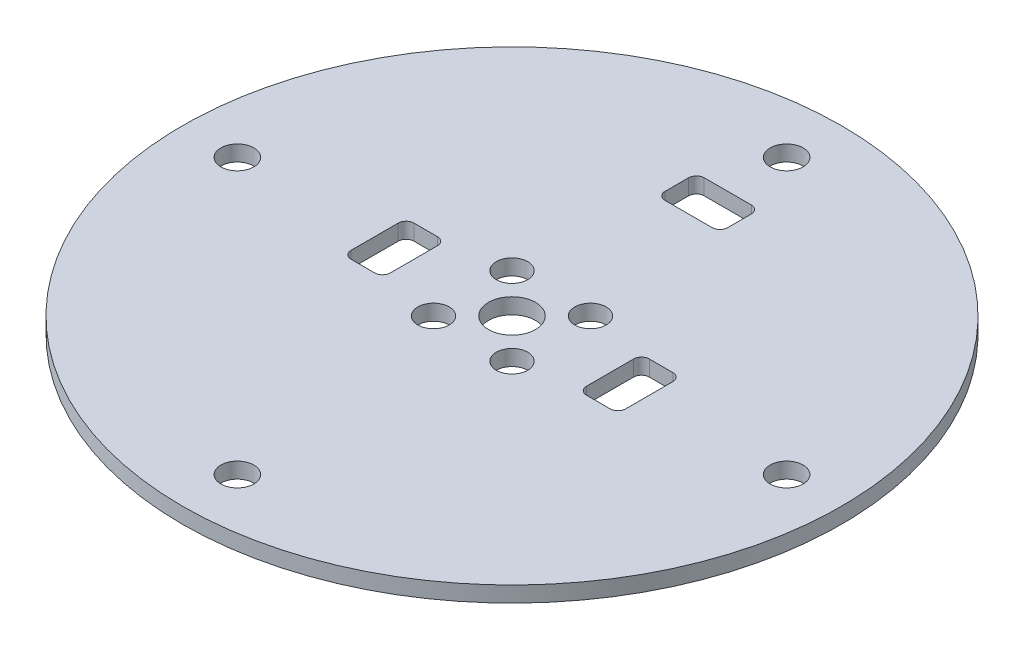
ISO-10303-21;
HEADER;
FILE_DESCRIPTION(('STEP AP214'),'2;1');
FILE_NAME('part.step','',(''),(''),'','','');
FILE_SCHEMA(('AUTOMOTIVE_DESIGN { 1 0 10303 214 1 1 1 1 }'));
ENDSEC;
DATA;
#1=APPLICATION_CONTEXT('core data for automotive mechanical design processes');
#2=APPLICATION_PROTOCOL_DEFINITION('international standard','automotive_design',2000,#1);
#3=PRODUCT_CONTEXT('',#1,'mechanical');
#4=PRODUCT('Part','Part','',(#3));
#5=PRODUCT_RELATED_PRODUCT_CATEGORY('part','',(#4));
#6=PRODUCT_DEFINITION_FORMATION('','',#4);
#7=PRODUCT_DEFINITION_CONTEXT('part definition',#1,'design');
#8=PRODUCT_DEFINITION('design','',#6,#7);
#9=PRODUCT_DEFINITION_SHAPE('','',#8);
#10=(LENGTH_UNIT() NAMED_UNIT(*) SI_UNIT(.MILLI.,.METRE.));
#11=(NAMED_UNIT(*) PLANE_ANGLE_UNIT() SI_UNIT($,.RADIAN.));
#12=(NAMED_UNIT(*) SI_UNIT($,.STERADIAN.) SOLID_ANGLE_UNIT());
#13=UNCERTAINTY_MEASURE_WITH_UNIT(LENGTH_MEASURE(1.E-05),#10,'distance_accuracy_value','');
#14=(GEOMETRIC_REPRESENTATION_CONTEXT(3) GLOBAL_UNCERTAINTY_ASSIGNED_CONTEXT((#13)) GLOBAL_UNIT_ASSIGNED_CONTEXT((#10,
#11,#12)) REPRESENTATION_CONTEXT('',''));
#15=CARTESIAN_POINT('',(0.,0.,0.));
#16=DIRECTION('',(0.,0.,1.));
#17=DIRECTION('',(1.,0.,0.));
#18=AXIS2_PLACEMENT_3D('',#15,#16,#17);
#19=CARTESIAN_POINT('',(0.,-2.,0.));
#20=DIRECTION('',(0.,1.,0.));
#21=DIRECTION('',(0.,0.,1.));
#22=AXIS2_PLACEMENT_3D('',#19,#20,#21);
#23=CYLINDRICAL_SURFACE('',#22,42.);
#24=CARTESIAN_POINT('',(0.,-2.,0.));
#25=DIRECTION('',(0.,1.,0.));
#26=DIRECTION('',(0.,0.,1.));
#27=AXIS2_PLACEMENT_3D('',#24,#25,#26);
#28=CIRCLE('',#27,42.);
#29=CARTESIAN_POINT('',(0.,-2.,42.));
#30=VERTEX_POINT('',#29);
#31=EDGE_CURVE('E216',#30,#30,#28,.T.);
#32=ORIENTED_EDGE('',*,*,#31,.T.);
#33=EDGE_LOOP('',(#32));
#34=FACE_BOUND('',#33,.T.);
#35=CARTESIAN_POINT('',(0.,0.,0.));
#36=DIRECTION('',(0.,1.,0.));
#37=DIRECTION('',(0.,0.,1.));
#38=AXIS2_PLACEMENT_3D('',#35,#36,#37);
#39=CIRCLE('',#38,42.);
#40=CARTESIAN_POINT('',(0.,0.,42.));
#41=VERTEX_POINT('',#40);
#42=EDGE_CURVE('E503',#41,#41,#39,.T.);
#43=ORIENTED_EDGE('',*,*,#42,.F.);
#44=EDGE_LOOP('',(#43));
#45=FACE_BOUND('',#44,.T.);
#46=ADVANCED_FACE('F41',(#34,#45),#23,.T.);
#47=CARTESIAN_POINT('',(0.,-2.,0.));
#48=DIRECTION('',(0.,1.,0.));
#49=DIRECTION('',(0.,0.,1.));
#50=AXIS2_PLACEMENT_3D('',#47,#48,#49);
#51=PLANE('',#50);
#52=CARTESIAN_POINT('',(0.,-2.,-35.));
#53=DIRECTION('',(0.,1.,0.));
#54=DIRECTION('',(0.,0.,1.));
#55=AXIS2_PLACEMENT_3D('',#52,#53,#54);
#56=CIRCLE('',#55,2.1);
#57=CARTESIAN_POINT('',(0.,-2.,-32.9));
#58=VERTEX_POINT('',#57);
#59=EDGE_CURVE('E506',#58,#58,#56,.F.);
#60=ORIENTED_EDGE('',*,*,#59,.F.);
#61=EDGE_LOOP('',(#60));
#62=FACE_BOUND('',#61,.T.);
#63=CARTESIAN_POINT('',(-4.99999999999989,-2.,5.));
#64=DIRECTION('',(0.,1.,0.));
#65=DIRECTION('',(0.,0.,1.));
#66=AXIS2_PLACEMENT_3D('',#63,#64,#65);
#67=CIRCLE('',#66,2.);
#68=CARTESIAN_POINT('',(-4.99999999999989,-2.,7.));
#69=VERTEX_POINT('',#68);
#70=EDGE_CURVE('E530',#69,#69,#67,.F.);
#71=ORIENTED_EDGE('',*,*,#70,.F.);
#72=EDGE_LOOP('',(#71));
#73=FACE_BOUND('',#72,.T.);
#74=DIRECTION('',(-1.,0.,0.));
#75=VECTOR('',#74,1.);
#76=CARTESIAN_POINT('',(17.5,-2.,3.99999999999999));
#77=LINE('',#76,#75);
#78=CARTESIAN_POINT('',(16.5,-2.,3.99999999999999));
#79=VERTEX_POINT('',#78);
#80=CARTESIAN_POINT('',(13.5,-2.,3.99999999999999));
#81=VERTEX_POINT('',#80);
#82=EDGE_CURVE('E529',#79,#81,#77,.T.);
#83=ORIENTED_EDGE('',*,*,#82,.F.);
#84=CARTESIAN_POINT('',(16.5,-2.,2.99999999999999));
#85=DIRECTION('',(0.,1.,0.));
#86=DIRECTION('',(0.,0.,1.));
#87=AXIS2_PLACEMENT_3D('',#84,#85,#86);
#88=CIRCLE('',#87,1.);
#89=CARTESIAN_POINT('',(17.5,-2.,2.99999999999999));
#90=VERTEX_POINT('',#89);
#91=EDGE_CURVE('E256',#79,#90,#88,.T.);
#92=ORIENTED_EDGE('',*,*,#91,.T.);
#93=DIRECTION('',(0.,0.,1.));
#94=VECTOR('',#93,1.);
#95=CARTESIAN_POINT('',(17.5,-2.,3.99999999999999));
#96=LINE('',#95,#94);
#97=CARTESIAN_POINT('',(17.5,-2.,-3.00000000000001));
#98=VERTEX_POINT('',#97);
#99=EDGE_CURVE('E534',#98,#90,#96,.T.);
#100=ORIENTED_EDGE('',*,*,#99,.F.);
#101=CARTESIAN_POINT('',(16.5,-2.,-3.00000000000001));
#102=DIRECTION('',(0.,1.,0.));
#103=DIRECTION('',(0.,0.,1.));
#104=AXIS2_PLACEMENT_3D('',#101,#102,#103);
#105=CIRCLE('',#104,1.);
#106=CARTESIAN_POINT('',(16.5,-2.,-4.00000000000001));
#107=VERTEX_POINT('',#106);
#108=EDGE_CURVE('E274',#98,#107,#105,.T.);
#109=ORIENTED_EDGE('',*,*,#108,.T.);
#110=DIRECTION('',(1.,0.,0.));
#111=VECTOR('',#110,1.);
#112=CARTESIAN_POINT('',(17.5,-2.,-4.00000000000001));
#113=LINE('',#112,#111);
#114=CARTESIAN_POINT('',(13.5,-2.,-4.));
#115=VERTEX_POINT('',#114);
#116=EDGE_CURVE('E521',#115,#107,#113,.T.);
#117=ORIENTED_EDGE('',*,*,#116,.F.);
#118=CARTESIAN_POINT('',(13.5,-2.,-3.));
#119=DIRECTION('',(0.,1.,0.));
#120=DIRECTION('',(0.,0.,1.));
#121=AXIS2_PLACEMENT_3D('',#118,#119,#120);
#122=CIRCLE('',#121,1.);
#123=CARTESIAN_POINT('',(12.5,-2.,-3.));
#124=VERTEX_POINT('',#123);
#125=EDGE_CURVE('E268',#115,#124,#122,.T.);
#126=ORIENTED_EDGE('',*,*,#125,.T.);
#127=DIRECTION('',(0.,0.,-1.));
#128=VECTOR('',#127,1.);
#129=CARTESIAN_POINT('',(12.5,-2.,3.99999999999999));
#130=LINE('',#129,#128);
#131=CARTESIAN_POINT('',(12.5,-2.,2.99999999999999));
#132=VERTEX_POINT('',#131);
#133=EDGE_CURVE('E525',#132,#124,#130,.T.);
#134=ORIENTED_EDGE('',*,*,#133,.F.);
#135=CARTESIAN_POINT('',(13.5,-2.,2.99999999999999));
#136=DIRECTION('',(0.,1.,0.));
#137=DIRECTION('',(0.,0.,1.));
#138=AXIS2_PLACEMENT_3D('',#135,#136,#137);
#139=CIRCLE('',#138,1.);
#140=EDGE_CURVE('E262',#132,#81,#139,.T.);
#141=ORIENTED_EDGE('',*,*,#140,.T.);
#142=EDGE_LOOP('',(#83,#92,#100,#109,#117,#126,#134,#141));
#143=FACE_BOUND('',#142,.T.);
#144=CARTESIAN_POINT('',(5.00000000000011,-2.,5.));
#145=DIRECTION('',(0.,1.,0.));
#146=DIRECTION('',(0.,0.,1.));
#147=AXIS2_PLACEMENT_3D('',#144,#145,#146);
#148=CIRCLE('',#147,2.);
#149=CARTESIAN_POINT('',(5.00000000000011,-2.,7.));
#150=VERTEX_POINT('',#149);
#151=EDGE_CURVE('E438',#150,#150,#148,.F.);
#152=ORIENTED_EDGE('',*,*,#151,.F.);
#153=EDGE_LOOP('',(#152));
#154=FACE_BOUND('',#153,.T.);
#155=CARTESIAN_POINT('',(-34.9999999999979,-2.,2.1479871457391E-12));
#156=DIRECTION('',(0.,1.,0.));
#157=DIRECTION('',(0.,0.,1.));
#158=AXIS2_PLACEMENT_3D('',#155,#156,#157);
#159=CIRCLE('',#158,2.1);
#160=CARTESIAN_POINT('',(-34.9999999999979,-2.,2.10000000000215));
#161=VERTEX_POINT('',#160);
#162=EDGE_CURVE('E473',#161,#161,#159,.F.);
#163=ORIENTED_EDGE('',*,*,#162,.F.);
#164=EDGE_LOOP('',(#163));
#165=FACE_BOUND('',#164,.T.);
#166=CARTESIAN_POINT('',(4.28801408728375E-12,-2.,35.));
#167=DIRECTION('',(0.,1.,0.));
#168=DIRECTION('',(0.,0.,1.));
#169=AXIS2_PLACEMENT_3D('',#166,#167,#168);
#170=CIRCLE('',#169,2.1);
#171=CARTESIAN_POINT('',(4.28801408728375E-12,-2.,37.1));
#172=VERTEX_POINT('',#171);
#173=EDGE_CURVE('E472',#172,#172,#170,.F.);
#174=ORIENTED_EDGE('',*,*,#173,.F.);
#175=EDGE_LOOP('',(#174));
#176=FACE_BOUND('',#175,.T.);
#177=CARTESIAN_POINT('',(35.0000000000021,-2.,-2.14370088194209E-12));
#178=DIRECTION('',(0.,1.,0.));
#179=DIRECTION('',(0.,0.,1.));
#180=AXIS2_PLACEMENT_3D('',#177,#178,#179);
#181=CIRCLE('',#180,2.1);
#182=CARTESIAN_POINT('',(35.0000000000021,-2.,2.09999999999785));
#183=VERTEX_POINT('',#182);
#184=EDGE_CURVE('E489',#183,#183,#181,.F.);
#185=ORIENTED_EDGE('',*,*,#184,.F.);
#186=EDGE_LOOP('',(#185));
#187=FACE_BOUND('',#186,.T.);
#188=CARTESIAN_POINT('',(0.,-2.,0.));
#189=DIRECTION('',(0.,1.,0.));
#190=DIRECTION('',(0.,0.,1.));
#191=AXIS2_PLACEMENT_3D('',#188,#189,#190);
#192=CIRCLE('',#191,3.);
#193=CARTESIAN_POINT('',(0.,-2.,3.));
#194=VERTEX_POINT('',#193);
#195=EDGE_CURVE('E488',#194,#194,#192,.F.);
#196=ORIENTED_EDGE('',*,*,#195,.F.);
#197=EDGE_LOOP('',(#196));
#198=FACE_BOUND('',#197,.T.);
#199=CARTESIAN_POINT('',(5.00000000000001,-2.,-5.));
#200=DIRECTION('',(0.,1.,0.));
#201=DIRECTION('',(0.,0.,1.));
#202=AXIS2_PLACEMENT_3D('',#199,#200,#201);
#203=CIRCLE('',#202,2.);
#204=CARTESIAN_POINT('',(5.00000000000001,-2.,-3.));
#205=VERTEX_POINT('',#204);
#206=EDGE_CURVE('E437',#205,#205,#203,.F.);
#207=ORIENTED_EDGE('',*,*,#206,.F.);
#208=EDGE_LOOP('',(#207));
#209=FACE_BOUND('',#208,.T.);
#210=DIRECTION('',(-1.,0.,0.));
#211=VECTOR('',#210,1.);
#212=CARTESIAN_POINT('',(-17.5,-2.,4.));
#213=LINE('',#212,#211);
#214=CARTESIAN_POINT('',(-13.5,-2.,4.));
#215=VERTEX_POINT('',#214);
#216=CARTESIAN_POINT('',(-16.5,-2.,4.));
#217=VERTEX_POINT('',#216);
#218=EDGE_CURVE('E422',#215,#217,#213,.T.);
#219=ORIENTED_EDGE('',*,*,#218,.F.);
#220=CARTESIAN_POINT('',(-13.5,-2.,3.));
#221=DIRECTION('',(0.,1.,0.));
#222=DIRECTION('',(0.,0.,1.));
#223=AXIS2_PLACEMENT_3D('',#220,#221,#222);
#224=CIRCLE('',#223,1.);
#225=CARTESIAN_POINT('',(-12.5,-2.,3.));
#226=VERTEX_POINT('',#225);
#227=EDGE_CURVE('E291',#215,#226,#224,.T.);
#228=ORIENTED_EDGE('',*,*,#227,.T.);
#229=DIRECTION('',(0.,0.,1.));
#230=VECTOR('',#229,1.);
#231=CARTESIAN_POINT('',(-12.5,-2.,4.));
#232=LINE('',#231,#230);
#233=CARTESIAN_POINT('',(-12.5,-2.,-3.));
#234=VERTEX_POINT('',#233);
#235=EDGE_CURVE('E412',#234,#226,#232,.T.);
#236=ORIENTED_EDGE('',*,*,#235,.F.);
#237=CARTESIAN_POINT('',(-13.5,-2.,-3.));
#238=DIRECTION('',(0.,1.,0.));
#239=DIRECTION('',(0.,0.,1.));
#240=AXIS2_PLACEMENT_3D('',#237,#238,#239);
#241=CIRCLE('',#240,1.);
#242=CARTESIAN_POINT('',(-13.5,-2.,-4.));
#243=VERTEX_POINT('',#242);
#244=EDGE_CURVE('E280',#234,#243,#241,.T.);
#245=ORIENTED_EDGE('',*,*,#244,.T.);
#246=DIRECTION('',(1.,0.,0.));
#247=VECTOR('',#246,1.);
#248=CARTESIAN_POINT('',(-17.5,-2.,-4.));
#249=LINE('',#248,#247);
#250=CARTESIAN_POINT('',(-16.5,-2.,-4.));
#251=VERTEX_POINT('',#250);
#252=EDGE_CURVE('E428',#251,#243,#249,.T.);
#253=ORIENTED_EDGE('',*,*,#252,.F.);
#254=CARTESIAN_POINT('',(-16.5,-2.,-3.));
#255=DIRECTION('',(0.,1.,0.));
#256=DIRECTION('',(0.,0.,1.));
#257=AXIS2_PLACEMENT_3D('',#254,#255,#256);
#258=CIRCLE('',#257,1.);
#259=CARTESIAN_POINT('',(-17.5,-2.,-3.));
#260=VERTEX_POINT('',#259);
#261=EDGE_CURVE('E286',#251,#260,#258,.T.);
#262=ORIENTED_EDGE('',*,*,#261,.T.);
#263=DIRECTION('',(0.,0.,-1.));
#264=VECTOR('',#263,1.);
#265=CARTESIAN_POINT('',(-17.5,-2.,4.));
#266=LINE('',#265,#264);
#267=CARTESIAN_POINT('',(-17.5,-2.,3.));
#268=VERTEX_POINT('',#267);
#269=EDGE_CURVE('E442',#268,#260,#266,.T.);
#270=ORIENTED_EDGE('',*,*,#269,.F.);
#271=CARTESIAN_POINT('',(-16.5,-2.,3.));
#272=DIRECTION('',(0.,1.,0.));
#273=DIRECTION('',(0.,0.,1.));
#274=AXIS2_PLACEMENT_3D('',#271,#272,#273);
#275=CIRCLE('',#274,1.);
#276=EDGE_CURVE('E11',#268,#217,#275,.T.);
#277=ORIENTED_EDGE('',*,*,#276,.T.);
#278=EDGE_LOOP('',(#219,#228,#236,#245,#253,#262,#270,#277));
#279=FACE_BOUND('',#278,.T.);
#280=CARTESIAN_POINT('',(-4.99999999999999,-2.,-5.));
#281=DIRECTION('',(0.,1.,0.));
#282=DIRECTION('',(0.,0.,1.));
#283=AXIS2_PLACEMENT_3D('',#280,#281,#282);
#284=CIRCLE('',#283,2.);
#285=CARTESIAN_POINT('',(-4.99999999999999,-2.,-3.));
#286=VERTEX_POINT('',#285);
#287=EDGE_CURVE('E447',#286,#286,#284,.F.);
#288=ORIENTED_EDGE('',*,*,#287,.F.);
#289=EDGE_LOOP('',(#288));
#290=FACE_BOUND('',#289,.T.);
#291=DIRECTION('',(1.,0.,0.));
#292=VECTOR('',#291,1.);
#293=CARTESIAN_POINT('',(4.,-2.,-27.5));
#294=LINE('',#293,#292);
#295=CARTESIAN_POINT('',(-3.,-2.,-27.5));
#296=VERTEX_POINT('',#295);
#297=CARTESIAN_POINT('',(3.,-2.,-27.5));
#298=VERTEX_POINT('',#297);
#299=EDGE_CURVE('E228',#296,#298,#294,.T.);
#300=ORIENTED_EDGE('',*,*,#299,.F.);
#301=CARTESIAN_POINT('',(-3.,-2.,-26.5));
#302=DIRECTION('',(0.,1.,0.));
#303=DIRECTION('',(0.,0.,1.));
#304=AXIS2_PLACEMENT_3D('',#301,#302,#303);
#305=CIRCLE('',#304,1.);
#306=CARTESIAN_POINT('',(-4.,-2.,-26.5));
#307=VERTEX_POINT('',#306);
#308=EDGE_CURVE('E226',#296,#307,#305,.T.);
#309=ORIENTED_EDGE('',*,*,#308,.T.);
#310=DIRECTION('',(0.,0.,-1.));
#311=VECTOR('',#310,1.);
#312=CARTESIAN_POINT('',(-4.,-2.,-22.5));
#313=LINE('',#312,#311);
#314=CARTESIAN_POINT('',(-4.,-2.,-23.5));
#315=VERTEX_POINT('',#314);
#316=EDGE_CURVE('E208',#315,#307,#313,.T.);
#317=ORIENTED_EDGE('',*,*,#316,.F.);
#318=CARTESIAN_POINT('',(-3.,-2.,-23.5));
#319=DIRECTION('',(0.,1.,0.));
#320=DIRECTION('',(0.,0.,1.));
#321=AXIS2_PLACEMENT_3D('',#318,#319,#320);
#322=CIRCLE('',#321,1.);
#323=CARTESIAN_POINT('',(-3.,-2.,-22.5));
#324=VERTEX_POINT('',#323);
#325=EDGE_CURVE('E223',#315,#324,#322,.T.);
#326=ORIENTED_EDGE('',*,*,#325,.T.);
#327=DIRECTION('',(-1.,0.,0.));
#328=VECTOR('',#327,1.);
#329=CARTESIAN_POINT('',(4.,-2.,-22.5));
#330=LINE('',#329,#328);
#331=CARTESIAN_POINT('',(3.,-2.,-22.5));
#332=VERTEX_POINT('',#331);
#333=EDGE_CURVE('E346',#332,#324,#330,.T.);
#334=ORIENTED_EDGE('',*,*,#333,.F.);
#335=CARTESIAN_POINT('',(3.,-2.,-23.5));
#336=DIRECTION('',(0.,1.,0.));
#337=DIRECTION('',(0.,0.,1.));
#338=AXIS2_PLACEMENT_3D('',#335,#336,#337);
#339=CIRCLE('',#338,1.);
#340=CARTESIAN_POINT('',(4.,-2.,-23.5));
#341=VERTEX_POINT('',#340);
#342=EDGE_CURVE('E240',#332,#341,#339,.T.);
#343=ORIENTED_EDGE('',*,*,#342,.T.);
#344=DIRECTION('',(0.,0.,1.));
#345=VECTOR('',#344,1.);
#346=CARTESIAN_POINT('',(4.,-2.,-22.5));
#347=LINE('',#346,#345);
#348=CARTESIAN_POINT('',(4.,-2.,-26.5));
#349=VERTEX_POINT('',#348);
#350=EDGE_CURVE('E443',#349,#341,#347,.T.);
#351=ORIENTED_EDGE('',*,*,#350,.F.);
#352=CARTESIAN_POINT('',(3.,-2.,-26.5));
#353=DIRECTION('',(0.,1.,0.));
#354=DIRECTION('',(0.,0.,1.));
#355=AXIS2_PLACEMENT_3D('',#352,#353,#354);
#356=CIRCLE('',#355,1.);
#357=EDGE_CURVE('E250',#349,#298,#356,.T.);
#358=ORIENTED_EDGE('',*,*,#357,.T.);
#359=EDGE_LOOP('',(#300,#309,#317,#326,#334,#343,#351,#358));
#360=FACE_BOUND('',#359,.T.);
#361=ORIENTED_EDGE('',*,*,#31,.F.);
#362=EDGE_LOOP('',(#361));
#363=FACE_BOUND('',#362,.T.);
#364=ADVANCED_FACE('F220',(#62,#73,#143,#154,#165,#176,#187,#198,#209,#279,#290,#360,#363),#51,.F.);
#365=CARTESIAN_POINT('',(0.,0.,0.));
#366=DIRECTION('',(0.,1.,0.));
#367=DIRECTION('',(0.,0.,1.));
#368=AXIS2_PLACEMENT_3D('',#365,#366,#367);
#369=PLANE('',#368);
#370=CARTESIAN_POINT('',(0.,0.,-35.));
#371=DIRECTION('',(0.,1.,0.));
#372=DIRECTION('',(0.,0.,1.));
#373=AXIS2_PLACEMENT_3D('',#370,#371,#372);
#374=CIRCLE('',#373,2.1);
#375=CARTESIAN_POINT('',(0.,0.,-32.9));
#376=VERTEX_POINT('',#375);
#377=EDGE_CURVE('E493',#376,#376,#374,.T.);
#378=ORIENTED_EDGE('',*,*,#377,.F.);
#379=EDGE_LOOP('',(#378));
#380=FACE_BOUND('',#379,.T.);
#381=CARTESIAN_POINT('',(-4.99999999999989,0.,5.));
#382=DIRECTION('',(0.,1.,0.));
#383=DIRECTION('',(0.,0.,1.));
#384=AXIS2_PLACEMENT_3D('',#381,#382,#383);
#385=CIRCLE('',#384,2.);
#386=CARTESIAN_POINT('',(-4.99999999999989,0.,7.));
#387=VERTEX_POINT('',#386);
#388=EDGE_CURVE('E557',#387,#387,#385,.T.);
#389=ORIENTED_EDGE('',*,*,#388,.F.);
#390=EDGE_LOOP('',(#389));
#391=FACE_BOUND('',#390,.T.);
#392=DIRECTION('',(0.,0.,-1.));
#393=VECTOR('',#392,1.);
#394=CARTESIAN_POINT('',(17.5,0.,3.99999999999999));
#395=LINE('',#394,#393);
#396=CARTESIAN_POINT('',(17.5,0.,2.99999999999999));
#397=VERTEX_POINT('',#396);
#398=CARTESIAN_POINT('',(17.5,0.,-3.00000000000001));
#399=VERTEX_POINT('',#398);
#400=EDGE_CURVE('E538',#397,#399,#395,.T.);
#401=ORIENTED_EDGE('',*,*,#400,.F.);
#402=CARTESIAN_POINT('',(16.5,0.,2.99999999999999));
#403=DIRECTION('',(0.,1.,0.));
#404=DIRECTION('',(0.,0.,1.));
#405=AXIS2_PLACEMENT_3D('',#402,#403,#404);
#406=CIRCLE('',#405,1.);
#407=CARTESIAN_POINT('',(16.5,0.,3.99999999999999));
#408=VERTEX_POINT('',#407);
#409=EDGE_CURVE('E253',#397,#408,#406,.F.);
#410=ORIENTED_EDGE('',*,*,#409,.T.);
#411=DIRECTION('',(1.,0.,0.));
#412=VECTOR('',#411,1.);
#413=CARTESIAN_POINT('',(17.5,0.,3.99999999999999));
#414=LINE('',#413,#412);
#415=CARTESIAN_POINT('',(13.5,0.,3.99999999999999));
#416=VERTEX_POINT('',#415);
#417=EDGE_CURVE('E550',#416,#408,#414,.T.);
#418=ORIENTED_EDGE('',*,*,#417,.F.);
#419=CARTESIAN_POINT('',(13.5,0.,2.99999999999999));
#420=DIRECTION('',(0.,1.,0.));
#421=DIRECTION('',(0.,0.,1.));
#422=AXIS2_PLACEMENT_3D('',#419,#420,#421);
#423=CIRCLE('',#422,1.);
#424=CARTESIAN_POINT('',(12.5,0.,2.99999999999999));
#425=VERTEX_POINT('',#424);
#426=EDGE_CURVE('E259',#416,#425,#423,.F.);
#427=ORIENTED_EDGE('',*,*,#426,.T.);
#428=DIRECTION('',(0.,0.,1.));
#429=VECTOR('',#428,1.);
#430=CARTESIAN_POINT('',(12.5,0.,3.99999999999999));
#431=LINE('',#430,#429);
#432=CARTESIAN_POINT('',(12.5,0.,-3.));
#433=VERTEX_POINT('',#432);
#434=EDGE_CURVE('E546',#433,#425,#431,.T.);
#435=ORIENTED_EDGE('',*,*,#434,.F.);
#436=CARTESIAN_POINT('',(13.5,0.,-3.));
#437=DIRECTION('',(0.,1.,0.));
#438=DIRECTION('',(0.,0.,1.));
#439=AXIS2_PLACEMENT_3D('',#436,#437,#438);
#440=CIRCLE('',#439,1.);
#441=CARTESIAN_POINT('',(13.5,0.,-4.));
#442=VERTEX_POINT('',#441);
#443=EDGE_CURVE('E265',#433,#442,#440,.F.);
#444=ORIENTED_EDGE('',*,*,#443,.T.);
#445=DIRECTION('',(-1.,0.,0.));
#446=VECTOR('',#445,1.);
#447=CARTESIAN_POINT('',(17.5,0.,-4.00000000000001));
#448=LINE('',#447,#446);
#449=CARTESIAN_POINT('',(16.5,0.,-4.00000000000001));
#450=VERTEX_POINT('',#449);
#451=EDGE_CURVE('E542',#450,#442,#448,.T.);
#452=ORIENTED_EDGE('',*,*,#451,.F.);
#453=CARTESIAN_POINT('',(16.5,0.,-3.00000000000001));
#454=DIRECTION('',(0.,1.,0.));
#455=DIRECTION('',(0.,0.,1.));
#456=AXIS2_PLACEMENT_3D('',#453,#454,#455);
#457=CIRCLE('',#456,1.);
#458=EDGE_CURVE('E271',#450,#399,#457,.F.);
#459=ORIENTED_EDGE('',*,*,#458,.T.);
#460=EDGE_LOOP('',(#401,#410,#418,#427,#435,#444,#452,#459));
#461=FACE_BOUND('',#460,.T.);
#462=CARTESIAN_POINT('',(5.00000000000011,0.,5.));
#463=DIRECTION('',(0.,1.,0.));
#464=DIRECTION('',(0.,0.,1.));
#465=AXIS2_PLACEMENT_3D('',#462,#463,#464);
#466=CIRCLE('',#465,2.);
#467=CARTESIAN_POINT('',(5.00000000000011,0.,7.));
#468=VERTEX_POINT('',#467);
#469=EDGE_CURVE('E517',#468,#468,#466,.T.);
#470=ORIENTED_EDGE('',*,*,#469,.F.);
#471=EDGE_LOOP('',(#470));
#472=FACE_BOUND('',#471,.T.);
#473=CARTESIAN_POINT('',(-34.9999999999979,0.,2.1479871457391E-12));
#474=DIRECTION('',(0.,1.,0.));
#475=DIRECTION('',(0.,0.,1.));
#476=AXIS2_PLACEMENT_3D('',#473,#474,#475);
#477=CIRCLE('',#476,2.1);
#478=CARTESIAN_POINT('',(-34.9999999999979,0.,2.10000000000215));
#479=VERTEX_POINT('',#478);
#480=EDGE_CURVE('E461',#479,#479,#477,.T.);
#481=ORIENTED_EDGE('',*,*,#480,.F.);
#482=EDGE_LOOP('',(#481));
#483=FACE_BOUND('',#482,.T.);
#484=CARTESIAN_POINT('',(4.28801408728375E-12,0.,35.));
#485=DIRECTION('',(0.,1.,0.));
#486=DIRECTION('',(0.,0.,1.));
#487=AXIS2_PLACEMENT_3D('',#484,#485,#486);
#488=CIRCLE('',#487,2.1);
#489=CARTESIAN_POINT('',(4.28801408728375E-12,0.,37.1));
#490=VERTEX_POINT('',#489);
#491=EDGE_CURVE('E468',#490,#490,#488,.T.);
#492=ORIENTED_EDGE('',*,*,#491,.F.);
#493=EDGE_LOOP('',(#492));
#494=FACE_BOUND('',#493,.T.);
#495=CARTESIAN_POINT('',(35.0000000000021,0.,-2.14370088194209E-12));
#496=DIRECTION('',(0.,1.,0.));
#497=DIRECTION('',(0.,0.,1.));
#498=AXIS2_PLACEMENT_3D('',#495,#496,#497);
#499=CIRCLE('',#498,2.1);
#500=CARTESIAN_POINT('',(35.0000000000021,0.,2.09999999999785));
#501=VERTEX_POINT('',#500);
#502=EDGE_CURVE('E477',#501,#501,#499,.T.);
#503=ORIENTED_EDGE('',*,*,#502,.F.);
#504=EDGE_LOOP('',(#503));
#505=FACE_BOUND('',#504,.T.);
#506=CARTESIAN_POINT('',(0.,0.,0.));
#507=DIRECTION('',(0.,1.,0.));
#508=DIRECTION('',(0.,0.,1.));
#509=AXIS2_PLACEMENT_3D('',#506,#507,#508);
#510=CIRCLE('',#509,3.);
#511=CARTESIAN_POINT('',(0.,0.,3.));
#512=VERTEX_POINT('',#511);
#513=EDGE_CURVE('E484',#512,#512,#510,.T.);
#514=ORIENTED_EDGE('',*,*,#513,.F.);
#515=EDGE_LOOP('',(#514));
#516=FACE_BOUND('',#515,.T.);
#517=CARTESIAN_POINT('',(5.00000000000001,0.,-5.));
#518=DIRECTION('',(0.,1.,0.));
#519=DIRECTION('',(0.,0.,1.));
#520=AXIS2_PLACEMENT_3D('',#517,#518,#519);
#521=CIRCLE('',#520,2.);
#522=CARTESIAN_POINT('',(5.00000000000001,0.,-3.));
#523=VERTEX_POINT('',#522);
#524=EDGE_CURVE('E433',#523,#523,#521,.T.);
#525=ORIENTED_EDGE('',*,*,#524,.F.);
#526=EDGE_LOOP('',(#525));
#527=FACE_BOUND('',#526,.T.);
#528=DIRECTION('',(0.,0.,-1.));
#529=VECTOR('',#528,1.);
#530=CARTESIAN_POINT('',(-12.5,0.,4.));
#531=LINE('',#530,#529);
#532=CARTESIAN_POINT('',(-12.5,0.,3.));
#533=VERTEX_POINT('',#532);
#534=CARTESIAN_POINT('',(-12.5,0.,-3.));
#535=VERTEX_POINT('',#534);
#536=EDGE_CURVE('E409',#533,#535,#531,.T.);
#537=ORIENTED_EDGE('',*,*,#536,.F.);
#538=CARTESIAN_POINT('',(-13.5,0.,3.));
#539=DIRECTION('',(0.,1.,0.));
#540=DIRECTION('',(0.,0.,1.));
#541=AXIS2_PLACEMENT_3D('',#538,#539,#540);
#542=CIRCLE('',#541,1.);
#543=CARTESIAN_POINT('',(-13.5,0.,4.));
#544=VERTEX_POINT('',#543);
#545=EDGE_CURVE('E57',#533,#544,#542,.F.);
#546=ORIENTED_EDGE('',*,*,#545,.T.);
#547=DIRECTION('',(1.,0.,0.));
#548=VECTOR('',#547,1.);
#549=CARTESIAN_POINT('',(-17.5,0.,4.));
#550=LINE('',#549,#548);
#551=CARTESIAN_POINT('',(-16.5,0.,4.));
#552=VERTEX_POINT('',#551);
#553=EDGE_CURVE('E299',#552,#544,#550,.T.);
#554=ORIENTED_EDGE('',*,*,#553,.F.);
#555=CARTESIAN_POINT('',(-16.5,0.,3.));
#556=DIRECTION('',(0.,1.,0.));
#557=DIRECTION('',(0.,0.,1.));
#558=AXIS2_PLACEMENT_3D('',#555,#556,#557);
#559=CIRCLE('',#558,1.);
#560=CARTESIAN_POINT('',(-17.5,0.,3.));
#561=VERTEX_POINT('',#560);
#562=EDGE_CURVE('E50',#552,#561,#559,.F.);
#563=ORIENTED_EDGE('',*,*,#562,.T.);
#564=DIRECTION('',(0.,0.,1.));
#565=VECTOR('',#564,1.);
#566=CARTESIAN_POINT('',(-17.5,0.,4.));
#567=LINE('',#566,#565);
#568=CARTESIAN_POINT('',(-17.5,0.,-3.));
#569=VERTEX_POINT('',#568);
#570=EDGE_CURVE('E298',#569,#561,#567,.T.);
#571=ORIENTED_EDGE('',*,*,#570,.F.);
#572=CARTESIAN_POINT('',(-16.5,0.,-3.));
#573=DIRECTION('',(0.,1.,0.));
#574=DIRECTION('',(0.,0.,1.));
#575=AXIS2_PLACEMENT_3D('',#572,#573,#574);
#576=CIRCLE('',#575,1.);
#577=CARTESIAN_POINT('',(-16.5,0.,-4.));
#578=VERTEX_POINT('',#577);
#579=EDGE_CURVE('E283',#569,#578,#576,.F.);
#580=ORIENTED_EDGE('',*,*,#579,.T.);
#581=DIRECTION('',(-1.,0.,0.));
#582=VECTOR('',#581,1.);
#583=CARTESIAN_POINT('',(-17.5,0.,-4.));
#584=LINE('',#583,#582);
#585=CARTESIAN_POINT('',(-13.5,0.,-4.));
#586=VERTEX_POINT('',#585);
#587=EDGE_CURVE('E309',#586,#578,#584,.T.);
#588=ORIENTED_EDGE('',*,*,#587,.F.);
#589=CARTESIAN_POINT('',(-13.5,0.,-3.));
#590=DIRECTION('',(0.,1.,0.));
#591=DIRECTION('',(0.,0.,1.));
#592=AXIS2_PLACEMENT_3D('',#589,#590,#591);
#593=CIRCLE('',#592,1.);
#594=EDGE_CURVE('E277',#586,#535,#593,.F.);
#595=ORIENTED_EDGE('',*,*,#594,.T.);
#596=EDGE_LOOP('',(#537,#546,#554,#563,#571,#580,#588,#595));
#597=FACE_BOUND('',#596,.T.);
#598=CARTESIAN_POINT('',(-4.99999999999999,0.,-5.));
#599=DIRECTION('',(0.,1.,0.));
#600=DIRECTION('',(0.,0.,1.));
#601=AXIS2_PLACEMENT_3D('',#598,#599,#600);
#602=CIRCLE('',#601,2.);
#603=CARTESIAN_POINT('',(-4.99999999999999,0.,-3.));
#604=VERTEX_POINT('',#603);
#605=EDGE_CURVE('E432',#604,#604,#602,.T.);
#606=ORIENTED_EDGE('',*,*,#605,.F.);
#607=EDGE_LOOP('',(#606));
#608=FACE_BOUND('',#607,.T.);
#609=DIRECTION('',(0.,0.,1.));
#610=VECTOR('',#609,1.);
#611=CARTESIAN_POINT('',(-4.,0.,-22.5));
#612=LINE('',#611,#610);
#613=CARTESIAN_POINT('',(-4.,0.,-26.5));
#614=VERTEX_POINT('',#613);
#615=CARTESIAN_POINT('',(-4.,0.,-23.5));
#616=VERTEX_POINT('',#615);
#617=EDGE_CURVE('E211',#614,#616,#612,.T.);
#618=ORIENTED_EDGE('',*,*,#617,.F.);
#619=CARTESIAN_POINT('',(-3.,0.,-26.5));
#620=DIRECTION('',(0.,1.,0.));
#621=DIRECTION('',(0.,0.,1.));
#622=AXIS2_PLACEMENT_3D('',#619,#620,#621);
#623=CIRCLE('',#622,1.);
#624=CARTESIAN_POINT('',(-3.,0.,-27.5));
#625=VERTEX_POINT('',#624);
#626=EDGE_CURVE('E328',#614,#625,#623,.F.);
#627=ORIENTED_EDGE('',*,*,#626,.T.);
#628=DIRECTION('',(-1.,0.,0.));
#629=VECTOR('',#628,1.);
#630=CARTESIAN_POINT('',(4.,0.,-27.5));
#631=LINE('',#630,#629);
#632=CARTESIAN_POINT('',(3.,0.,-27.5));
#633=VERTEX_POINT('',#632);
#634=EDGE_CURVE('E335',#633,#625,#631,.T.);
#635=ORIENTED_EDGE('',*,*,#634,.F.);
#636=CARTESIAN_POINT('',(3.,0.,-26.5));
#637=DIRECTION('',(0.,1.,0.));
#638=DIRECTION('',(0.,0.,1.));
#639=AXIS2_PLACEMENT_3D('',#636,#637,#638);
#640=CIRCLE('',#639,1.);
#641=CARTESIAN_POINT('',(4.,0.,-26.5));
#642=VERTEX_POINT('',#641);
#643=EDGE_CURVE('E247',#633,#642,#640,.F.);
#644=ORIENTED_EDGE('',*,*,#643,.T.);
#645=DIRECTION('',(0.,0.,-1.));
#646=VECTOR('',#645,1.);
#647=CARTESIAN_POINT('',(4.,0.,-22.5));
#648=LINE('',#647,#646);
#649=CARTESIAN_POINT('',(4.,0.,-23.5));
#650=VERTEX_POINT('',#649);
#651=EDGE_CURVE('E347',#650,#642,#648,.T.);
#652=ORIENTED_EDGE('',*,*,#651,.F.);
#653=CARTESIAN_POINT('',(3.,0.,-23.5));
#654=DIRECTION('',(0.,1.,0.));
#655=DIRECTION('',(0.,0.,1.));
#656=AXIS2_PLACEMENT_3D('',#653,#654,#655);
#657=CIRCLE('',#656,1.);
#658=CARTESIAN_POINT('',(3.,0.,-22.5));
#659=VERTEX_POINT('',#658);
#660=EDGE_CURVE('E235',#650,#659,#657,.F.);
#661=ORIENTED_EDGE('',*,*,#660,.T.);
#662=DIRECTION('',(1.,0.,0.));
#663=VECTOR('',#662,1.);
#664=CARTESIAN_POINT('',(4.,0.,-22.5));
#665=LINE('',#664,#663);
#666=CARTESIAN_POINT('',(-3.,0.,-22.5));
#667=VERTEX_POINT('',#666);
#668=EDGE_CURVE('E452',#667,#659,#665,.T.);
#669=ORIENTED_EDGE('',*,*,#668,.F.);
#670=CARTESIAN_POINT('',(-3.,0.,-23.5));
#671=DIRECTION('',(0.,1.,0.));
#672=DIRECTION('',(0.,0.,1.));
#673=AXIS2_PLACEMENT_3D('',#670,#671,#672);
#674=CIRCLE('',#673,1.);
#675=EDGE_CURVE('E236',#667,#616,#674,.F.);
#676=ORIENTED_EDGE('',*,*,#675,.T.);
#677=EDGE_LOOP('',(#618,#627,#635,#644,#652,#661,#669,#676));
#678=FACE_BOUND('',#677,.T.);
#679=ORIENTED_EDGE('',*,*,#42,.T.);
#680=EDGE_LOOP('',(#679));
#681=FACE_BOUND('',#680,.T.);
#682=ADVANCED_FACE('F296',(#380,#391,#461,#472,#483,#494,#505,#516,#527,#597,#608,#678,#681),
#369,.T.);
#683=CARTESIAN_POINT('',(-4.,-2.001,-22.5));
#684=DIRECTION('',(-1.,0.,0.));
#685=DIRECTION('',(0.,0.,1.));
#686=AXIS2_PLACEMENT_3D('',#683,#684,#685);
#687=PLANE('',#686);
#688=ORIENTED_EDGE('',*,*,#316,.T.);
#689=DIRECTION('',(0.,1.,0.));
#690=VECTOR('',#689,1.);
#691=CARTESIAN_POINT('',(-4.,0.,-26.5));
#692=LINE('',#691,#690);
#693=EDGE_CURVE('E215',#307,#614,#692,.T.);
#694=ORIENTED_EDGE('',*,*,#693,.T.);
#695=ORIENTED_EDGE('',*,*,#617,.T.);
#696=DIRECTION('',(0.,1.,0.));
#697=VECTOR('',#696,1.);
#698=CARTESIAN_POINT('',(-4.,-2.,-23.5));
#699=LINE('',#698,#697);
#700=EDGE_CURVE('E204',#616,#315,#699,.F.);
#701=ORIENTED_EDGE('',*,*,#700,.T.);
#702=EDGE_LOOP('',(#688,#694,#695,#701));
#703=FACE_BOUND('',#702,.T.);
#704=ADVANCED_FACE('F206',(#703),#687,.F.);
#705=CARTESIAN_POINT('',(4.,-2.001,-27.5));
#706=DIRECTION('',(0.,0.,-1.));
#707=DIRECTION('',(-1.,0.,0.));
#708=AXIS2_PLACEMENT_3D('',#705,#706,#707);
#709=PLANE('',#708);
#710=ORIENTED_EDGE('',*,*,#634,.T.);
#711=DIRECTION('',(0.,1.,0.));
#712=VECTOR('',#711,1.);
#713=CARTESIAN_POINT('',(-3.,-2.,-27.5));
#714=LINE('',#713,#712);
#715=EDGE_CURVE('E342',#625,#296,#714,.F.);
#716=ORIENTED_EDGE('',*,*,#715,.T.);
#717=ORIENTED_EDGE('',*,*,#299,.T.);
#718=DIRECTION('',(0.,1.,0.));
#719=VECTOR('',#718,1.);
#720=CARTESIAN_POINT('',(3.,0.,-27.5));
#721=LINE('',#720,#719);
#722=EDGE_CURVE('E344',#298,#633,#721,.T.);
#723=ORIENTED_EDGE('',*,*,#722,.T.);
#724=EDGE_LOOP('',(#710,#716,#717,#723));
#725=FACE_BOUND('',#724,.T.);
#726=ADVANCED_FACE('F340',(#725),#709,.F.);
#727=CARTESIAN_POINT('',(4.,-2.001,-22.5));
#728=DIRECTION('',(1.,0.,0.));
#729=DIRECTION('',(0.,0.,-1.));
#730=AXIS2_PLACEMENT_3D('',#727,#728,#729);
#731=PLANE('',#730);
#732=ORIENTED_EDGE('',*,*,#350,.T.);
#733=DIRECTION('',(0.,1.,0.));
#734=VECTOR('',#733,1.);
#735=CARTESIAN_POINT('',(4.,0.,-23.5));
#736=LINE('',#735,#734);
#737=EDGE_CURVE('E364',#341,#650,#736,.T.);
#738=ORIENTED_EDGE('',*,*,#737,.T.);
#739=ORIENTED_EDGE('',*,*,#651,.T.);
#740=DIRECTION('',(0.,1.,0.));
#741=VECTOR('',#740,1.);
#742=CARTESIAN_POINT('',(4.,-2.,-26.5));
#743=LINE('',#742,#741);
#744=EDGE_CURVE('E361',#642,#349,#743,.F.);
#745=ORIENTED_EDGE('',*,*,#744,.T.);
#746=EDGE_LOOP('',(#732,#738,#739,#745));
#747=FACE_BOUND('',#746,.T.);
#748=ADVANCED_FACE('F652',(#747),#731,.F.);
#749=CARTESIAN_POINT('',(4.,-2.001,-22.5));
#750=DIRECTION('',(0.,0.,1.));
#751=DIRECTION('',(1.,0.,0.));
#752=AXIS2_PLACEMENT_3D('',#749,#750,#751);
#753=PLANE('',#752);
#754=ORIENTED_EDGE('',*,*,#333,.T.);
#755=DIRECTION('',(0.,1.,0.));
#756=VECTOR('',#755,1.);
#757=CARTESIAN_POINT('',(-3.,0.,-22.5));
#758=LINE('',#757,#756);
#759=EDGE_CURVE('E233',#324,#667,#758,.T.);
#760=ORIENTED_EDGE('',*,*,#759,.T.);
#761=ORIENTED_EDGE('',*,*,#668,.T.);
#762=DIRECTION('',(0.,1.,0.));
#763=VECTOR('',#762,1.);
#764=CARTESIAN_POINT('',(3.,-2.,-22.5));
#765=LINE('',#764,#763);
#766=EDGE_CURVE('E351',#659,#332,#765,.F.);
#767=ORIENTED_EDGE('',*,*,#766,.T.);
#768=EDGE_LOOP('',(#754,#760,#761,#767));
#769=FACE_BOUND('',#768,.T.);
#770=ADVANCED_FACE('F655',(#769),#753,.F.);
#771=CARTESIAN_POINT('',(-4.99999999999999,-2.001,-5.));
#772=DIRECTION('',(0.,1.,0.));
#773=DIRECTION('',(0.,0.,1.));
#774=AXIS2_PLACEMENT_3D('',#771,#772,#773);
#775=CYLINDRICAL_SURFACE('',#774,2.);
#776=ORIENTED_EDGE('',*,*,#605,.T.);
#777=EDGE_LOOP('',(#776));
#778=FACE_BOUND('',#777,.T.);
#779=ORIENTED_EDGE('',*,*,#287,.T.);
#780=EDGE_LOOP('',(#779));
#781=FACE_BOUND('',#780,.T.);
#782=ADVANCED_FACE('F648',(#778,#781),#775,.F.);
#783=CARTESIAN_POINT('',(-12.5,-2.001,4.));
#784=DIRECTION('',(1.,0.,0.));
#785=DIRECTION('',(0.,0.,-1.));
#786=AXIS2_PLACEMENT_3D('',#783,#784,#785);
#787=PLANE('',#786);
#788=ORIENTED_EDGE('',*,*,#536,.T.);
#789=DIRECTION('',(0.,1.,0.));
#790=VECTOR('',#789,1.);
#791=CARTESIAN_POINT('',(-12.5,-2.,-3.));
#792=LINE('',#791,#790);
#793=EDGE_CURVE('E313',#535,#234,#792,.F.);
#794=ORIENTED_EDGE('',*,*,#793,.T.);
#795=ORIENTED_EDGE('',*,*,#235,.T.);
#796=DIRECTION('',(0.,1.,0.));
#797=VECTOR('',#796,1.);
#798=CARTESIAN_POINT('',(-12.5,0.,3.));
#799=LINE('',#798,#797);
#800=EDGE_CURVE('E319',#226,#533,#799,.T.);
#801=ORIENTED_EDGE('',*,*,#800,.T.);
#802=EDGE_LOOP('',(#788,#794,#795,#801));
#803=FACE_BOUND('',#802,.T.);
#804=ADVANCED_FACE('F408',(#803),#787,.F.);
#805=CARTESIAN_POINT('',(-17.5,-2.001,4.));
#806=DIRECTION('',(0.,0.,1.));
#807=DIRECTION('',(1.,0.,0.));
#808=AXIS2_PLACEMENT_3D('',#805,#806,#807);
#809=PLANE('',#808);
#810=ORIENTED_EDGE('',*,*,#553,.T.);
#811=DIRECTION('',(0.,1.,0.));
#812=VECTOR('',#811,1.);
#813=CARTESIAN_POINT('',(-13.5,-2.,4.));
#814=LINE('',#813,#812);
#815=EDGE_CURVE('E325',#544,#215,#814,.F.);
#816=ORIENTED_EDGE('',*,*,#815,.T.);
#817=ORIENTED_EDGE('',*,*,#218,.T.);
#818=DIRECTION('',(0.,1.,0.));
#819=VECTOR('',#818,1.);
#820=CARTESIAN_POINT('',(-16.5,0.,4.));
#821=LINE('',#820,#819);
#822=EDGE_CURVE('E317',#217,#552,#821,.T.);
#823=ORIENTED_EDGE('',*,*,#822,.T.);
#824=EDGE_LOOP('',(#810,#816,#817,#823));
#825=FACE_BOUND('',#824,.T.);
#826=ADVANCED_FACE('F569',(#825),#809,.F.);
#827=CARTESIAN_POINT('',(-17.5,-2.001,4.));
#828=DIRECTION('',(-1.,0.,0.));
#829=DIRECTION('',(0.,0.,1.));
#830=AXIS2_PLACEMENT_3D('',#827,#828,#829);
#831=PLANE('',#830);
#832=ORIENTED_EDGE('',*,*,#269,.T.);
#833=DIRECTION('',(0.,1.,0.));
#834=VECTOR('',#833,1.);
#835=CARTESIAN_POINT('',(-17.5,0.,-3.));
#836=LINE('',#835,#834);
#837=EDGE_CURVE('E307',#260,#569,#836,.T.);
#838=ORIENTED_EDGE('',*,*,#837,.T.);
#839=ORIENTED_EDGE('',*,*,#570,.T.);
#840=DIRECTION('',(0.,1.,0.));
#841=VECTOR('',#840,1.);
#842=CARTESIAN_POINT('',(-17.5,-2.,3.));
#843=LINE('',#842,#841);
#844=EDGE_CURVE('E304',#561,#268,#843,.F.);
#845=ORIENTED_EDGE('',*,*,#844,.T.);
#846=EDGE_LOOP('',(#832,#838,#839,#845));
#847=FACE_BOUND('',#846,.T.);
#848=ADVANCED_FACE('F303',(#847),#831,.F.);
#849=CARTESIAN_POINT('',(-17.5,-2.001,-4.));
#850=DIRECTION('',(0.,0.,-1.));
#851=DIRECTION('',(-1.,0.,0.));
#852=AXIS2_PLACEMENT_3D('',#849,#850,#851);
#853=PLANE('',#852);
#854=ORIENTED_EDGE('',*,*,#252,.T.);
#855=DIRECTION('',(0.,1.,0.));
#856=VECTOR('',#855,1.);
#857=CARTESIAN_POINT('',(-13.5,0.,-4.));
#858=LINE('',#857,#856);
#859=EDGE_CURVE('E399',#243,#586,#858,.T.);
#860=ORIENTED_EDGE('',*,*,#859,.T.);
#861=ORIENTED_EDGE('',*,*,#587,.T.);
#862=DIRECTION('',(0.,1.,0.));
#863=VECTOR('',#862,1.);
#864=CARTESIAN_POINT('',(-16.5,-2.,-4.));
#865=LINE('',#864,#863);
#866=EDGE_CURVE('E396',#578,#251,#865,.F.);
#867=ORIENTED_EDGE('',*,*,#866,.T.);
#868=EDGE_LOOP('',(#854,#860,#861,#867));
#869=FACE_BOUND('',#868,.T.);
#870=ADVANCED_FACE('F632',(#869),#853,.F.);
#871=CARTESIAN_POINT('',(5.00000000000001,-2.001,-5.));
#872=DIRECTION('',(0.,1.,0.));
#873=DIRECTION('',(0.,0.,1.));
#874=AXIS2_PLACEMENT_3D('',#871,#872,#873);
#875=CYLINDRICAL_SURFACE('',#874,2.);
#876=ORIENTED_EDGE('',*,*,#524,.T.);
#877=EDGE_LOOP('',(#876));
#878=FACE_BOUND('',#877,.T.);
#879=ORIENTED_EDGE('',*,*,#206,.T.);
#880=EDGE_LOOP('',(#879));
#881=FACE_BOUND('',#880,.T.);
#882=ADVANCED_FACE('F635',(#878,#881),#875,.F.);
#883=CARTESIAN_POINT('',(0.,-2.001,0.));
#884=DIRECTION('',(0.,1.,0.));
#885=DIRECTION('',(0.,0.,1.));
#886=AXIS2_PLACEMENT_3D('',#883,#884,#885);
#887=CYLINDRICAL_SURFACE('',#886,3.);
#888=ORIENTED_EDGE('',*,*,#513,.T.);
#889=EDGE_LOOP('',(#888));
#890=FACE_BOUND('',#889,.T.);
#891=ORIENTED_EDGE('',*,*,#195,.T.);
#892=EDGE_LOOP('',(#891));
#893=FACE_BOUND('',#892,.T.);
#894=ADVANCED_FACE('F641',(#890,#893),#887,.F.);
#895=CARTESIAN_POINT('',(35.0000000000021,-2.001,-2.14370088194209E-12));
#896=DIRECTION('',(0.,1.,0.));
#897=DIRECTION('',(0.,0.,1.));
#898=AXIS2_PLACEMENT_3D('',#895,#896,#897);
#899=CYLINDRICAL_SURFACE('',#898,2.1);
#900=ORIENTED_EDGE('',*,*,#502,.T.);
#901=EDGE_LOOP('',(#900));
#902=FACE_BOUND('',#901,.T.);
#903=ORIENTED_EDGE('',*,*,#184,.T.);
#904=EDGE_LOOP('',(#903));
#905=FACE_BOUND('',#904,.T.);
#906=ADVANCED_FACE('F669',(#902,#905),#899,.F.);
#907=CARTESIAN_POINT('',(4.28801408728375E-12,-2.001,35.));
#908=DIRECTION('',(0.,1.,0.));
#909=DIRECTION('',(0.,0.,1.));
#910=AXIS2_PLACEMENT_3D('',#907,#908,#909);
#911=CYLINDRICAL_SURFACE('',#910,2.1);
#912=ORIENTED_EDGE('',*,*,#491,.T.);
#913=EDGE_LOOP('',(#912));
#914=FACE_BOUND('',#913,.T.);
#915=ORIENTED_EDGE('',*,*,#173,.T.);
#916=EDGE_LOOP('',(#915));
#917=FACE_BOUND('',#916,.T.);
#918=ADVANCED_FACE('F665',(#914,#917),#911,.F.);
#919=CARTESIAN_POINT('',(-34.9999999999979,-2.001,2.1479871457391E-12));
#920=DIRECTION('',(0.,1.,0.));
#921=DIRECTION('',(0.,0.,1.));
#922=AXIS2_PLACEMENT_3D('',#919,#920,#921);
#923=CYLINDRICAL_SURFACE('',#922,2.1);
#924=ORIENTED_EDGE('',*,*,#480,.T.);
#925=EDGE_LOOP('',(#924));
#926=FACE_BOUND('',#925,.T.);
#927=ORIENTED_EDGE('',*,*,#162,.T.);
#928=EDGE_LOOP('',(#927));
#929=FACE_BOUND('',#928,.T.);
#930=ADVANCED_FACE('F668',(#926,#929),#923,.F.);
#931=CARTESIAN_POINT('',(5.00000000000011,-2.001,5.));
#932=DIRECTION('',(0.,1.,0.));
#933=DIRECTION('',(0.,0.,1.));
#934=AXIS2_PLACEMENT_3D('',#931,#932,#933);
#935=CYLINDRICAL_SURFACE('',#934,2.);
#936=ORIENTED_EDGE('',*,*,#469,.T.);
#937=EDGE_LOOP('',(#936));
#938=FACE_BOUND('',#937,.T.);
#939=ORIENTED_EDGE('',*,*,#151,.T.);
#940=EDGE_LOOP('',(#939));
#941=FACE_BOUND('',#940,.T.);
#942=ADVANCED_FACE('F673',(#938,#941),#935,.F.);
#943=CARTESIAN_POINT('',(17.5,-2.001,3.99999999999999));
#944=DIRECTION('',(1.,0.,0.));
#945=DIRECTION('',(0.,0.,-1.));
#946=AXIS2_PLACEMENT_3D('',#943,#944,#945);
#947=PLANE('',#946);
#948=ORIENTED_EDGE('',*,*,#99,.T.);
#949=DIRECTION('',(0.,1.,0.));
#950=VECTOR('',#949,1.);
#951=CARTESIAN_POINT('',(17.5,0.,2.99999999999999));
#952=LINE('',#951,#950);
#953=EDGE_CURVE('E371',#90,#397,#952,.T.);
#954=ORIENTED_EDGE('',*,*,#953,.T.);
#955=ORIENTED_EDGE('',*,*,#400,.T.);
#956=DIRECTION('',(0.,1.,0.));
#957=VECTOR('',#956,1.);
#958=CARTESIAN_POINT('',(17.5,-2.,-3.00000000000001));
#959=LINE('',#958,#957);
#960=EDGE_CURVE('E368',#399,#98,#959,.F.);
#961=ORIENTED_EDGE('',*,*,#960,.T.);
#962=EDGE_LOOP('',(#948,#954,#955,#961));
#963=FACE_BOUND('',#962,.T.);
#964=ADVANCED_FACE('F720',(#963),#947,.F.);
#965=CARTESIAN_POINT('',(17.5,-2.001,3.99999999999999));
#966=DIRECTION('',(0.,0.,1.));
#967=DIRECTION('',(1.,0.,0.));
#968=AXIS2_PLACEMENT_3D('',#965,#966,#967);
#969=PLANE('',#968);
#970=ORIENTED_EDGE('',*,*,#417,.T.);
#971=DIRECTION('',(0.,1.,0.));
#972=VECTOR('',#971,1.);
#973=CARTESIAN_POINT('',(16.5,-2.,3.99999999999999));
#974=LINE('',#973,#972);
#975=EDGE_CURVE('E379',#408,#79,#974,.F.);
#976=ORIENTED_EDGE('',*,*,#975,.T.);
#977=ORIENTED_EDGE('',*,*,#82,.T.);
#978=DIRECTION('',(0.,1.,0.));
#979=VECTOR('',#978,1.);
#980=CARTESIAN_POINT('',(13.5,0.,3.99999999999999));
#981=LINE('',#980,#979);
#982=EDGE_CURVE('E375',#81,#416,#981,.T.);
#983=ORIENTED_EDGE('',*,*,#982,.T.);
#984=EDGE_LOOP('',(#970,#976,#977,#983));
#985=FACE_BOUND('',#984,.T.);
#986=ADVANCED_FACE('F727',(#985),#969,.F.);
#987=CARTESIAN_POINT('',(12.5,-2.001,3.99999999999999));
#988=DIRECTION('',(-1.,0.,0.));
#989=DIRECTION('',(0.,0.,1.));
#990=AXIS2_PLACEMENT_3D('',#987,#988,#989);
#991=PLANE('',#990);
#992=ORIENTED_EDGE('',*,*,#434,.T.);
#993=DIRECTION('',(0.,1.,0.));
#994=VECTOR('',#993,1.);
#995=CARTESIAN_POINT('',(12.5,-2.,2.99999999999999));
#996=LINE('',#995,#994);
#997=EDGE_CURVE('E386',#425,#132,#996,.F.);
#998=ORIENTED_EDGE('',*,*,#997,.T.);
#999=ORIENTED_EDGE('',*,*,#133,.T.);
#1000=DIRECTION('',(0.,1.,0.));
#1001=VECTOR('',#1000,1.);
#1002=CARTESIAN_POINT('',(12.5,0.,-3.));
#1003=LINE('',#1002,#1001);
#1004=EDGE_CURVE('E382',#124,#433,#1003,.T.);
#1005=ORIENTED_EDGE('',*,*,#1004,.T.);
#1006=EDGE_LOOP('',(#992,#998,#999,#1005));
#1007=FACE_BOUND('',#1006,.T.);
#1008=ADVANCED_FACE('F734',(#1007),#991,.F.);
#1009=CARTESIAN_POINT('',(17.5,-2.001,-4.00000000000001));
#1010=DIRECTION('',(0.,0.,-1.));
#1011=DIRECTION('',(-1.,0.,0.));
#1012=AXIS2_PLACEMENT_3D('',#1009,#1010,#1011);
#1013=PLANE('',#1012);
#1014=ORIENTED_EDGE('',*,*,#451,.T.);
#1015=DIRECTION('',(0.,1.,0.));
#1016=VECTOR('',#1015,1.);
#1017=CARTESIAN_POINT('',(13.5,-2.,-4.));
#1018=LINE('',#1017,#1016);
#1019=EDGE_CURVE('E393',#442,#115,#1018,.F.);
#1020=ORIENTED_EDGE('',*,*,#1019,.T.);
#1021=ORIENTED_EDGE('',*,*,#116,.T.);
#1022=DIRECTION('',(0.,1.,0.));
#1023=VECTOR('',#1022,1.);
#1024=CARTESIAN_POINT('',(16.5,0.,-4.00000000000001));
#1025=LINE('',#1024,#1023);
#1026=EDGE_CURVE('E389',#107,#450,#1025,.T.);
#1027=ORIENTED_EDGE('',*,*,#1026,.T.);
#1028=EDGE_LOOP('',(#1014,#1020,#1021,#1027));
#1029=FACE_BOUND('',#1028,.T.);
#1030=ADVANCED_FACE('F738',(#1029),#1013,.F.);
#1031=CARTESIAN_POINT('',(-4.99999999999989,-2.001,5.));
#1032=DIRECTION('',(0.,1.,0.));
#1033=DIRECTION('',(0.,0.,1.));
#1034=AXIS2_PLACEMENT_3D('',#1031,#1032,#1033);
#1035=CYLINDRICAL_SURFACE('',#1034,2.);
#1036=ORIENTED_EDGE('',*,*,#388,.T.);
#1037=EDGE_LOOP('',(#1036));
#1038=FACE_BOUND('',#1037,.T.);
#1039=ORIENTED_EDGE('',*,*,#70,.T.);
#1040=EDGE_LOOP('',(#1039));
#1041=FACE_BOUND('',#1040,.T.);
#1042=ADVANCED_FACE('F741',(#1038,#1041),#1035,.F.);
#1043=CARTESIAN_POINT('',(0.,-2.001,-35.));
#1044=DIRECTION('',(0.,1.,0.));
#1045=DIRECTION('',(0.,0.,1.));
#1046=AXIS2_PLACEMENT_3D('',#1043,#1044,#1045);
#1047=CYLINDRICAL_SURFACE('',#1046,2.1);
#1048=ORIENTED_EDGE('',*,*,#377,.T.);
#1049=EDGE_LOOP('',(#1048));
#1050=FACE_BOUND('',#1049,.T.);
#1051=ORIENTED_EDGE('',*,*,#59,.T.);
#1052=EDGE_LOOP('',(#1051));
#1053=FACE_BOUND('',#1052,.T.);
#1054=ADVANCED_FACE('F596',(#1050,#1053),#1047,.F.);
#1055=CARTESIAN_POINT('',(-3.,-2.001,-26.5));
#1056=DIRECTION('',(0.,-1.,0.));
#1057=DIRECTION('',(0.,0.,-1.));
#1058=AXIS2_PLACEMENT_3D('',#1055,#1056,#1057);
#1059=CYLINDRICAL_SURFACE('',#1058,1.);
#1060=ORIENTED_EDGE('',*,*,#308,.F.);
#1061=ORIENTED_EDGE('',*,*,#715,.F.);
#1062=ORIENTED_EDGE('',*,*,#626,.F.);
#1063=ORIENTED_EDGE('',*,*,#693,.F.);
#1064=EDGE_LOOP('',(#1060,#1061,#1062,#1063));
#1065=FACE_BOUND('',#1064,.T.);
#1066=ADVANCED_FACE('F349',(#1065),#1059,.F.);
#1067=CARTESIAN_POINT('',(-3.,-2.001,-23.5));
#1068=DIRECTION('',(0.,-1.,0.));
#1069=DIRECTION('',(0.,0.,-1.));
#1070=AXIS2_PLACEMENT_3D('',#1067,#1068,#1069);
#1071=CYLINDRICAL_SURFACE('',#1070,1.);
#1072=ORIENTED_EDGE('',*,*,#325,.F.);
#1073=ORIENTED_EDGE('',*,*,#700,.F.);
#1074=ORIENTED_EDGE('',*,*,#675,.F.);
#1075=ORIENTED_EDGE('',*,*,#759,.F.);
#1076=EDGE_LOOP('',(#1072,#1073,#1074,#1075));
#1077=FACE_BOUND('',#1076,.T.);
#1078=ADVANCED_FACE('F231',(#1077),#1071,.F.);
#1079=CARTESIAN_POINT('',(3.,-2.001,-23.5));
#1080=DIRECTION('',(0.,-1.,0.));
#1081=DIRECTION('',(0.,0.,-1.));
#1082=AXIS2_PLACEMENT_3D('',#1079,#1080,#1081);
#1083=CYLINDRICAL_SURFACE('',#1082,1.);
#1084=ORIENTED_EDGE('',*,*,#342,.F.);
#1085=ORIENTED_EDGE('',*,*,#766,.F.);
#1086=ORIENTED_EDGE('',*,*,#660,.F.);
#1087=ORIENTED_EDGE('',*,*,#737,.F.);
#1088=EDGE_LOOP('',(#1084,#1085,#1086,#1087));
#1089=FACE_BOUND('',#1088,.T.);
#1090=ADVANCED_FACE('F599',(#1089),#1083,.F.);
#1091=CARTESIAN_POINT('',(3.,-2.001,-26.5));
#1092=DIRECTION('',(0.,-1.,0.));
#1093=DIRECTION('',(0.,0.,-1.));
#1094=AXIS2_PLACEMENT_3D('',#1091,#1092,#1093);
#1095=CYLINDRICAL_SURFACE('',#1094,1.);
#1096=ORIENTED_EDGE('',*,*,#357,.F.);
#1097=ORIENTED_EDGE('',*,*,#744,.F.);
#1098=ORIENTED_EDGE('',*,*,#643,.F.);
#1099=ORIENTED_EDGE('',*,*,#722,.F.);
#1100=EDGE_LOOP('',(#1096,#1097,#1098,#1099));
#1101=FACE_BOUND('',#1100,.T.);
#1102=ADVANCED_FACE('F602',(#1101),#1095,.F.);
#1103=CARTESIAN_POINT('',(16.5,-2.001,2.99999999999999));
#1104=DIRECTION('',(0.,-1.,0.));
#1105=DIRECTION('',(0.,0.,-1.));
#1106=AXIS2_PLACEMENT_3D('',#1103,#1104,#1105);
#1107=CYLINDRICAL_SURFACE('',#1106,1.);
#1108=ORIENTED_EDGE('',*,*,#91,.F.);
#1109=ORIENTED_EDGE('',*,*,#975,.F.);
#1110=ORIENTED_EDGE('',*,*,#409,.F.);
#1111=ORIENTED_EDGE('',*,*,#953,.F.);
#1112=EDGE_LOOP('',(#1108,#1109,#1110,#1111));
#1113=FACE_BOUND('',#1112,.T.);
#1114=ADVANCED_FACE('F606',(#1113),#1107,.F.);
#1115=CARTESIAN_POINT('',(13.5,-2.001,2.99999999999999));
#1116=DIRECTION('',(0.,-1.,0.));
#1117=DIRECTION('',(0.,0.,-1.));
#1118=AXIS2_PLACEMENT_3D('',#1115,#1116,#1117);
#1119=CYLINDRICAL_SURFACE('',#1118,1.);
#1120=ORIENTED_EDGE('',*,*,#140,.F.);
#1121=ORIENTED_EDGE('',*,*,#997,.F.);
#1122=ORIENTED_EDGE('',*,*,#426,.F.);
#1123=ORIENTED_EDGE('',*,*,#982,.F.);
#1124=EDGE_LOOP('',(#1120,#1121,#1122,#1123));
#1125=FACE_BOUND('',#1124,.T.);
#1126=ADVANCED_FACE('F610',(#1125),#1119,.F.);
#1127=CARTESIAN_POINT('',(13.5,-2.001,-3.));
#1128=DIRECTION('',(0.,-1.,0.));
#1129=DIRECTION('',(0.,0.,-1.));
#1130=AXIS2_PLACEMENT_3D('',#1127,#1128,#1129);
#1131=CYLINDRICAL_SURFACE('',#1130,1.);
#1132=ORIENTED_EDGE('',*,*,#125,.F.);
#1133=ORIENTED_EDGE('',*,*,#1019,.F.);
#1134=ORIENTED_EDGE('',*,*,#443,.F.);
#1135=ORIENTED_EDGE('',*,*,#1004,.F.);
#1136=EDGE_LOOP('',(#1132,#1133,#1134,#1135));
#1137=FACE_BOUND('',#1136,.T.);
#1138=ADVANCED_FACE('F614',(#1137),#1131,.F.);
#1139=CARTESIAN_POINT('',(16.5,-2.001,-3.00000000000001));
#1140=DIRECTION('',(0.,-1.,0.));
#1141=DIRECTION('',(0.,0.,-1.));
#1142=AXIS2_PLACEMENT_3D('',#1139,#1140,#1141);
#1143=CYLINDRICAL_SURFACE('',#1142,1.);
#1144=ORIENTED_EDGE('',*,*,#108,.F.);
#1145=ORIENTED_EDGE('',*,*,#960,.F.);
#1146=ORIENTED_EDGE('',*,*,#458,.F.);
#1147=ORIENTED_EDGE('',*,*,#1026,.F.);
#1148=EDGE_LOOP('',(#1144,#1145,#1146,#1147));
#1149=FACE_BOUND('',#1148,.T.);
#1150=ADVANCED_FACE('F618',(#1149),#1143,.F.);
#1151=CARTESIAN_POINT('',(-13.5,-2.001,-3.));
#1152=DIRECTION('',(0.,-1.,0.));
#1153=DIRECTION('',(0.,0.,-1.));
#1154=AXIS2_PLACEMENT_3D('',#1151,#1152,#1153);
#1155=CYLINDRICAL_SURFACE('',#1154,1.);
#1156=ORIENTED_EDGE('',*,*,#244,.F.);
#1157=ORIENTED_EDGE('',*,*,#793,.F.);
#1158=ORIENTED_EDGE('',*,*,#594,.F.);
#1159=ORIENTED_EDGE('',*,*,#859,.F.);
#1160=EDGE_LOOP('',(#1156,#1157,#1158,#1159));
#1161=FACE_BOUND('',#1160,.T.);
#1162=ADVANCED_FACE('F580',(#1161),#1155,.F.);
#1163=CARTESIAN_POINT('',(-16.5,-2.001,-3.));
#1164=DIRECTION('',(0.,-1.,0.));
#1165=DIRECTION('',(0.,0.,-1.));
#1166=AXIS2_PLACEMENT_3D('',#1163,#1164,#1165);
#1167=CYLINDRICAL_SURFACE('',#1166,1.);
#1168=ORIENTED_EDGE('',*,*,#261,.F.);
#1169=ORIENTED_EDGE('',*,*,#866,.F.);
#1170=ORIENTED_EDGE('',*,*,#579,.F.);
#1171=ORIENTED_EDGE('',*,*,#837,.F.);
#1172=EDGE_LOOP('',(#1168,#1169,#1170,#1171));
#1173=FACE_BOUND('',#1172,.T.);
#1174=ADVANCED_FACE('F575',(#1173),#1167,.F.);
#1175=CARTESIAN_POINT('',(-13.5,-2.001,3.));
#1176=DIRECTION('',(0.,-1.,0.));
#1177=DIRECTION('',(0.,0.,-1.));
#1178=AXIS2_PLACEMENT_3D('',#1175,#1176,#1177);
#1179=CYLINDRICAL_SURFACE('',#1178,1.);
#1180=ORIENTED_EDGE('',*,*,#227,.F.);
#1181=ORIENTED_EDGE('',*,*,#815,.F.);
#1182=ORIENTED_EDGE('',*,*,#545,.F.);
#1183=ORIENTED_EDGE('',*,*,#800,.F.);
#1184=EDGE_LOOP('',(#1180,#1181,#1182,#1183));
#1185=FACE_BOUND('',#1184,.T.);
#1186=ADVANCED_FACE('F573',(#1185),#1179,.F.);
#1187=CARTESIAN_POINT('',(-16.5,-2.001,3.));
#1188=DIRECTION('',(0.,-1.,0.));
#1189=DIRECTION('',(0.,0.,-1.));
#1190=AXIS2_PLACEMENT_3D('',#1187,#1188,#1189);
#1191=CYLINDRICAL_SURFACE('',#1190,1.);
#1192=ORIENTED_EDGE('',*,*,#276,.F.);
#1193=ORIENTED_EDGE('',*,*,#844,.F.);
#1194=ORIENTED_EDGE('',*,*,#562,.F.);
#1195=ORIENTED_EDGE('',*,*,#822,.F.);
#1196=EDGE_LOOP('',(#1192,#1193,#1194,#1195));
#1197=FACE_BOUND('',#1196,.T.);
#1198=ADVANCED_FACE('F43',(#1197),#1191,.F.);
#1199=CLOSED_SHELL('',(#46,#364,#682,#704,#726,#748,#770,#782,#804,#826,#848,#870,#882,#894,
#906,#918,#930,#942,#964,#986,#1008,#1030,#1042,#1054,#1066,#1078,#1090,#1102,#1114,#1126,#1138,
#1150,#1162,#1174,#1186,#1198));
#1200=MANIFOLD_SOLID_BREP('B2',#1199);
#1201=ADVANCED_BREP_SHAPE_REPRESENTATION('',(#18,#1200),#14);
#1202=SHAPE_DEFINITION_REPRESENTATION(#9,#1201);
ENDSEC;
END-ISO-10303-21;
